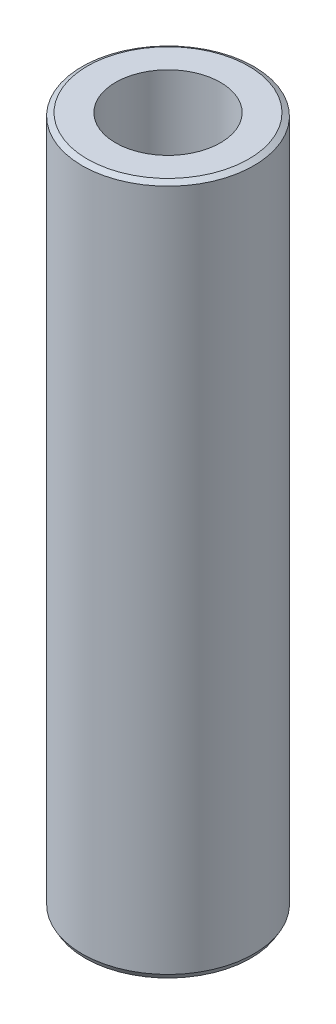
ISO-10303-21;
HEADER;
FILE_DESCRIPTION(('STEP AP214'),'2;1');
FILE_NAME('part.step','',(''),(''),'','','');
FILE_SCHEMA(('AUTOMOTIVE_DESIGN { 1 0 10303 214 1 1 1 1 }'));
ENDSEC;
DATA;
#1=APPLICATION_CONTEXT('core data for automotive mechanical design processes');
#2=APPLICATION_PROTOCOL_DEFINITION('international standard','automotive_design',2000,#1);
#3=PRODUCT_CONTEXT('',#1,'mechanical');
#4=PRODUCT('Part','Part','',(#3));
#5=PRODUCT_RELATED_PRODUCT_CATEGORY('part','',(#4));
#6=PRODUCT_DEFINITION_FORMATION('','',#4);
#7=PRODUCT_DEFINITION_CONTEXT('part definition',#1,'design');
#8=PRODUCT_DEFINITION('design','',#6,#7);
#9=PRODUCT_DEFINITION_SHAPE('','',#8);
#10=(LENGTH_UNIT() NAMED_UNIT(*) SI_UNIT(.MILLI.,.METRE.));
#11=(NAMED_UNIT(*) PLANE_ANGLE_UNIT() SI_UNIT($,.RADIAN.));
#12=(NAMED_UNIT(*) SI_UNIT($,.STERADIAN.) SOLID_ANGLE_UNIT());
#13=UNCERTAINTY_MEASURE_WITH_UNIT(LENGTH_MEASURE(1.E-05),#10,'distance_accuracy_value','');
#14=(GEOMETRIC_REPRESENTATION_CONTEXT(3) GLOBAL_UNCERTAINTY_ASSIGNED_CONTEXT((#13)) GLOBAL_UNIT_ASSIGNED_CONTEXT((#10,
#11,#12)) REPRESENTATION_CONTEXT('',''));
#15=CARTESIAN_POINT('',(0.,0.,0.));
#16=DIRECTION('',(0.,0.,1.));
#17=DIRECTION('',(1.,0.,0.));
#18=AXIS2_PLACEMENT_3D('',#15,#16,#17);
#19=CARTESIAN_POINT('',(0.,180.987040027659,0.));
#20=DIRECTION('',(0.,-1.,0.));
#21=DIRECTION('',(0.,0.,-1.));
#22=AXIS2_PLACEMENT_3D('',#19,#20,#21);
#23=CYLINDRICAL_SURFACE('',#22,22.5);
#24=CARTESIAN_POINT('',(0.,180.191002808618,0.));
#25=DIRECTION('',(0.,1.,0.));
#26=DIRECTION('',(0.,0.,1.));
#27=AXIS2_PLACEMENT_3D('',#24,#25,#26);
#28=CIRCLE('',#27,22.5);
#29=CARTESIAN_POINT('',(0.,180.191002808618,22.5));
#30=VERTEX_POINT('',#29);
#31=EDGE_CURVE('E50',#30,#30,#28,.F.);
#32=ORIENTED_EDGE('',*,*,#31,.T.);
#33=EDGE_LOOP('',(#32));
#34=FACE_BOUND('',#33,.T.);
#35=CARTESIAN_POINT('',(0.,1.37877690809407,0.));
#36=DIRECTION('',(0.,1.,0.));
#37=DIRECTION('',(0.,0.,1.));
#38=AXIS2_PLACEMENT_3D('',#35,#36,#37);
#39=CIRCLE('',#38,22.5);
#40=CARTESIAN_POINT('',(0.,1.37877690809407,22.5));
#41=VERTEX_POINT('',#40);
#42=EDGE_CURVE('E51',#41,#41,#39,.T.);
#43=ORIENTED_EDGE('',*,*,#42,.T.);
#44=EDGE_LOOP('',(#43));
#45=FACE_BOUND('',#44,.T.);
#46=ADVANCED_FACE('F39',(#34,#45),#23,.T.);
#47=CARTESIAN_POINT('',(0.,180.987040027659,0.));
#48=DIRECTION('',(0.,1.,0.));
#49=DIRECTION('',(0.,0.,1.));
#50=AXIS2_PLACEMENT_3D('',#47,#48,#49);
#51=PLANE('',#50);
#52=CARTESIAN_POINT('',(0.,180.987040027659,0.));
#53=DIRECTION('',(0.,1.,0.));
#54=DIRECTION('',(0.,0.,1.));
#55=AXIS2_PLACEMENT_3D('',#52,#53,#54);
#56=CIRCLE('',#55,21.1212230919059);
#57=CARTESIAN_POINT('',(0.,180.987040027659,21.1212230919059));
#58=VERTEX_POINT('',#57);
#59=EDGE_CURVE('E54',#58,#58,#56,.T.);
#60=ORIENTED_EDGE('',*,*,#59,.T.);
#61=EDGE_LOOP('',(#60));
#62=FACE_BOUND('',#61,.T.);
#63=CARTESIAN_POINT('',(0.,180.987040027659,0.));
#64=DIRECTION('',(0.,1.,0.));
#65=DIRECTION('',(0.,0.,1.));
#66=AXIS2_PLACEMENT_3D('',#63,#64,#65);
#67=CIRCLE('',#66,13.7376845558539);
#68=CARTESIAN_POINT('',(0.,180.987040027659,13.7376845558539));
#69=VERTEX_POINT('',#68);
#70=EDGE_CURVE('E58',#69,#69,#67,.T.);
#71=ORIENTED_EDGE('',*,*,#70,.F.);
#72=EDGE_LOOP('',(#71));
#73=FACE_BOUND('',#72,.T.);
#74=ADVANCED_FACE('F69',(#62,#73),#51,.T.);
#75=CARTESIAN_POINT('',(0.,0.,0.));
#76=DIRECTION('',(0.,1.,0.));
#77=DIRECTION('',(0.,0.,1.));
#78=AXIS2_PLACEMENT_3D('',#75,#76,#77);
#79=PLANE('',#78);
#80=CARTESIAN_POINT('',(0.,0.,0.));
#81=DIRECTION('',(0.,1.,0.));
#82=DIRECTION('',(0.,0.,1.));
#83=AXIS2_PLACEMENT_3D('',#80,#81,#82);
#84=CIRCLE('',#83,21.7039627809595);
#85=CARTESIAN_POINT('',(0.,0.,21.7039627809595));
#86=VERTEX_POINT('',#85);
#87=EDGE_CURVE('E10',#86,#86,#84,.F.);
#88=ORIENTED_EDGE('',*,*,#87,.T.);
#89=EDGE_LOOP('',(#88));
#90=FACE_BOUND('',#89,.T.);
#91=CARTESIAN_POINT('',(0.,0.,0.));
#92=DIRECTION('',(0.,1.,0.));
#93=DIRECTION('',(0.,0.,1.));
#94=AXIS2_PLACEMENT_3D('',#91,#92,#93);
#95=CIRCLE('',#94,13.7376845558539);
#96=CARTESIAN_POINT('',(0.,0.,13.7376845558539));
#97=VERTEX_POINT('',#96);
#98=EDGE_CURVE('E63',#97,#97,#95,.T.);
#99=ORIENTED_EDGE('',*,*,#98,.T.);
#100=EDGE_LOOP('',(#99));
#101=FACE_BOUND('',#100,.T.);
#102=ADVANCED_FACE('F75',(#90,#101),#79,.F.);
#103=CARTESIAN_POINT('',(0.,180.987040027659,0.));
#104=DIRECTION('',(0.,-1.,0.));
#105=DIRECTION('',(0.,0.,-1.));
#106=AXIS2_PLACEMENT_3D('',#103,#104,#105);
#107=CYLINDRICAL_SURFACE('',#106,13.7376845558539);
#108=ORIENTED_EDGE('',*,*,#70,.T.);
#109=EDGE_LOOP('',(#108));
#110=FACE_BOUND('',#109,.T.);
#111=ORIENTED_EDGE('',*,*,#98,.F.);
#112=EDGE_LOOP('',(#111));
#113=FACE_BOUND('',#112,.T.);
#114=ADVANCED_FACE('F70',(#110,#113),#107,.F.);
#115=CARTESIAN_POINT('',(0.,180.987040027659,0.));
#116=DIRECTION('',(0.,-1.,0.));
#117=DIRECTION('',(0.,0.,-1.));
#118=AXIS2_PLACEMENT_3D('',#115,#116,#117);
#119=CONICAL_SURFACE('',#118,21.1212230919059,1.04719755119659);
#120=ORIENTED_EDGE('',*,*,#31,.F.);
#121=EDGE_LOOP('',(#120));
#122=FACE_BOUND('',#121,.T.);
#123=ORIENTED_EDGE('',*,*,#59,.F.);
#124=EDGE_LOOP('',(#123));
#125=FACE_BOUND('',#124,.T.);
#126=ADVANCED_FACE('F81',(#122,#125),#119,.T.);
#127=CARTESIAN_POINT('',(0.,1.37877690809407,0.));
#128=DIRECTION('',(0.,1.,0.));
#129=DIRECTION('',(0.,0.,1.));
#130=AXIS2_PLACEMENT_3D('',#127,#128,#129);
#131=CONICAL_SURFACE('',#130,22.5,0.523598775598296);
#132=CARTESIAN_POINT('',(0.,0.,21.7039627809595));
#133=CARTESIAN_POINT('',(0.,0.014362259459313,21.7122548353245));
#134=CARTESIAN_POINT('',(0.,0.0287245189186262,21.7205468896895));
#135=CARTESIAN_POINT('',(0.,0.0574490378372527,21.7371309984195));
#136=CARTESIAN_POINT('',(0.,0.0718112972965659,21.7454230527845));
#137=CARTESIAN_POINT('',(0.,0.100535816215192,21.7620071615145));
#138=CARTESIAN_POINT('',(0.,0.114898075674506,21.7702992158795));
#139=CARTESIAN_POINT('',(0.,0.143622594593132,21.7868833246095));
#140=CARTESIAN_POINT('',(0.,0.157984854052445,21.7951753789745));
#141=CARTESIAN_POINT('',(0.,0.186709372971072,21.8117594877045));
#142=CARTESIAN_POINT('',(0.,0.201071632430385,21.8200515420695));
#143=CARTESIAN_POINT('',(0.,0.229796151349012,21.8366356507995));
#144=CARTESIAN_POINT('',(0.,0.244158410808325,21.8449277051646));
#145=CARTESIAN_POINT('',(0.,0.272882929726951,21.8615118138946));
#146=CARTESIAN_POINT('',(0.,0.287245189186264,21.8698038682596));
#147=CARTESIAN_POINT('',(0.,0.315969708104891,21.8863879769896));
#148=CARTESIAN_POINT('',(0.,0.330331967564204,21.8946800313546));
#149=CARTESIAN_POINT('',(0.,0.359056486482831,21.9112641400846));
#150=CARTESIAN_POINT('',(0.,0.373418745942144,21.9195561944496));
#151=CARTESIAN_POINT('',(0.,0.40214326486077,21.9361403031796));
#152=CARTESIAN_POINT('',(0.,0.416505524320083,21.9444323575446));
#153=CARTESIAN_POINT('',(0.,0.44523004323871,21.9610164662746));
#154=CARTESIAN_POINT('',(0.,0.459592302698023,21.9693085206396));
#155=CARTESIAN_POINT('',(0.,0.48831682161665,21.9858926293697));
#156=CARTESIAN_POINT('',(0.,0.502679081075963,21.9941846837347));
#157=CARTESIAN_POINT('',(0.,0.531403599994589,22.0107687924647));
#158=CARTESIAN_POINT('',(0.,0.545765859453903,22.0190608468297));
#159=CARTESIAN_POINT('',(0.,0.574490378372529,22.0356449555597));
#160=CARTESIAN_POINT('',(0.,0.588852637831842,22.0439370099247));
#161=CARTESIAN_POINT('',(0.,0.617577156750469,22.0605211186547));
#162=CARTESIAN_POINT('',(0.,0.631939416209782,22.0688131730197));
#163=CARTESIAN_POINT('',(0.,0.660663935128409,22.0853972817497));
#164=CARTESIAN_POINT('',(0.,0.675026194587722,22.0936893361147));
#165=CARTESIAN_POINT('',(0.,0.703750713506348,22.1102734448447));
#166=CARTESIAN_POINT('',(0.,0.718112972965661,22.1185654992097));
#167=CARTESIAN_POINT('',(0.,0.746837491884288,22.1351496079398));
#168=CARTESIAN_POINT('',(0.,0.761199751343601,22.1434416623048));
#169=CARTESIAN_POINT('',(0.,0.789924270262228,22.1600257710348));
#170=CARTESIAN_POINT('',(0.,0.804286529721541,22.1683178253998));
#171=CARTESIAN_POINT('',(0.,0.833011048640167,22.1849019341298));
#172=CARTESIAN_POINT('',(0.,0.847373308099481,22.1931939884948));
#173=CARTESIAN_POINT('',(0.,0.876097827018107,22.2097780972248));
#174=CARTESIAN_POINT('',(0.,0.89046008647742,22.2180701515898));
#175=CARTESIAN_POINT('',(0.,0.919184605396047,22.2346542603198));
#176=CARTESIAN_POINT('',(0.,0.93354686485536,22.2429463146848));
#177=CARTESIAN_POINT('',(0.,0.962271383773986,22.2595304234148));
#178=CARTESIAN_POINT('',(0.,0.9766336432333,22.2678224777798));
#179=CARTESIAN_POINT('',(0.,1.00535816215193,22.2844065865099));
#180=CARTESIAN_POINT('',(0.,1.01972042161124,22.2926986408749));
#181=CARTESIAN_POINT('',(0.,1.04844494052987,22.3092827496049));
#182=CARTESIAN_POINT('',(0.,1.06280719998918,22.3175748039699));
#183=CARTESIAN_POINT('',(0.,1.09153171890781,22.3341589126999));
#184=CARTESIAN_POINT('',(0.,1.10589397836712,22.3424509670649));
#185=CARTESIAN_POINT('',(0.,1.13461849728575,22.3590350757949));
#186=CARTESIAN_POINT('',(0.,1.14898075674506,22.3673271301599));
#187=CARTESIAN_POINT('',(0.,1.17770527566368,22.3839112388899));
#188=CARTESIAN_POINT('',(0.,1.192067535123,22.3922032932549));
#189=CARTESIAN_POINT('',(0.,1.22079205404162,22.4087874019849));
#190=CARTESIAN_POINT('',(0.,1.23515431350094,22.4170794563499));
#191=CARTESIAN_POINT('',(0.,1.26387883241956,22.43366356508));
#192=CARTESIAN_POINT('',(0.,1.27824109187888,22.441955619445));
#193=CARTESIAN_POINT('',(0.,1.3069656107975,22.458539728175));
#194=CARTESIAN_POINT('',(0.,1.32132787025682,22.46683178254));
#195=CARTESIAN_POINT('',(0.,1.35005238917544,22.48341589127));
#196=CARTESIAN_POINT('',(0.,1.36441464863476,22.491707945635));
#197=CARTESIAN_POINT('',(0.,1.37877690809407,22.5));
#198=B_SPLINE_CURVE_WITH_KNOTS('',3,(#132,#133,#134,#135,#136,#137,#138,#139,#140,#141,#142,
#143,#144,#145,#146,#147,#148,#149,#150,#151,#152,#153,#154,#155,#156,#157,#158,#159,#160,#161,
#162,#163,#164,#165,#166,#167,#168,#169,#170,#171,#172,#173,#174,#175,#176,#177,#178,#179,#180,
#181,#182,#183,#184,#185,#186,#187,#188,#189,#190,#191,#192,#193,#194,#195,#196,#197),
.UNSPECIFIED.,.F.,.F.,(4,2,2,2,2,2,2,2,2,2,2,2,2,2,2,2,2,2,2,2,2,2,2,2,2,2,2,2,2,2,2,2,4),(0.,
0.0497523261900342,0.0995046523800684,0.149256978570103,0.199009304760137,0.248761630950171,
0.298513957140205,0.348266283330241,0.398018609520275,0.44777093571031,0.497523261900344,
0.547275588090378,0.597027914280412,0.646780240470446,0.696532566660481,0.746284892850515,
0.796037219040549,0.845789545230585,0.895541871420619,0.945294197610653,0.995046523800688,
1.04479884999072,1.09455117618076,1.14430350237079,1.19405582856083,1.24380815475086,
1.29356048094089,1.34331280713093,1.39306513332096,1.442817459511,1.49256978570103,
1.54232211189107,1.5920744380811),.UNSPECIFIED.);
#199=EDGE_CURVE('BSEAM45',#86,#41,#198,.T.);
#200=ORIENTED_EDGE('',*,*,#87,.F.);
#201=ORIENTED_EDGE('',*,*,#42,.F.);
#202=ORIENTED_EDGE('',*,*,#199,.T.);
#203=ORIENTED_EDGE('',*,*,#199,.F.);
#204=EDGE_LOOP('',(#200,#202,#201,#203));
#205=FACE_BOUND('',#204,.T.);
#206=ADVANCED_FACE('F45',(#205),#131,.T.);
#207=CLOSED_SHELL('',(#46,#74,#102,#114,#126,#206));
#208=MANIFOLD_SOLID_BREP('B2',#207);
#209=ADVANCED_BREP_SHAPE_REPRESENTATION('',(#18,#208),#14);
#210=SHAPE_DEFINITION_REPRESENTATION(#9,#209);
ENDSEC;
END-ISO-10303-21;
